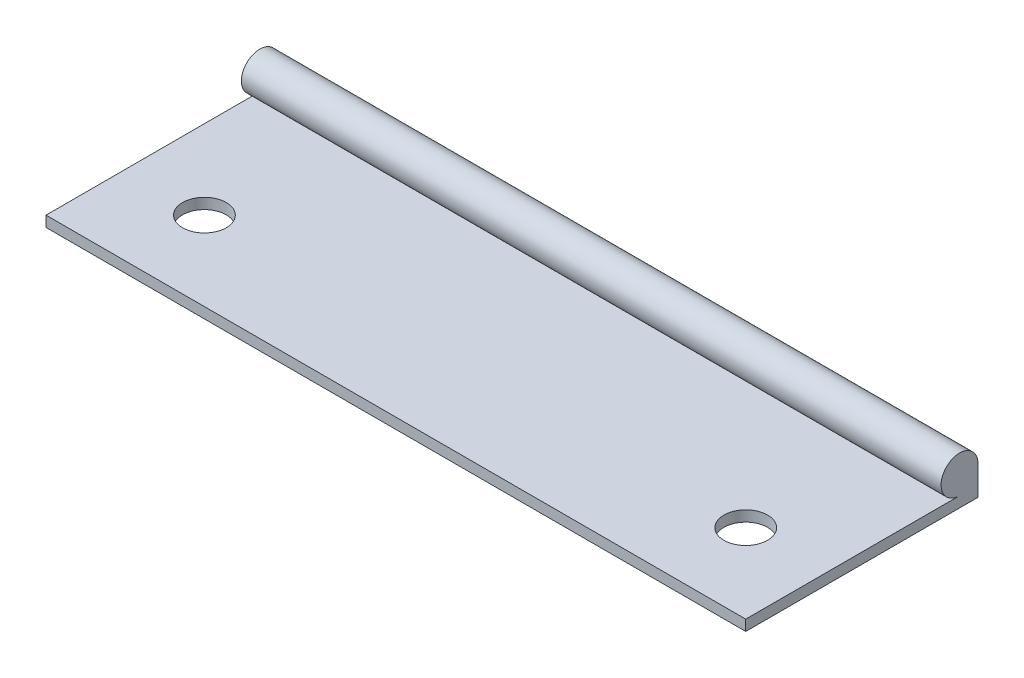
ISO-10303-21;
HEADER;
FILE_DESCRIPTION(('STEP AP214'),'2;1');
FILE_NAME('part.step','',(''),(''),'','','');
FILE_SCHEMA(('AUTOMOTIVE_DESIGN { 1 0 10303 214 1 1 1 1 }'));
ENDSEC;
DATA;
#1=APPLICATION_CONTEXT('core data for automotive mechanical design processes');
#2=APPLICATION_PROTOCOL_DEFINITION('international standard','automotive_design',2000,#1);
#3=PRODUCT_CONTEXT('',#1,'mechanical');
#4=PRODUCT('Part','Part','',(#3));
#5=PRODUCT_RELATED_PRODUCT_CATEGORY('part','',(#4));
#6=PRODUCT_DEFINITION_FORMATION('','',#4);
#7=PRODUCT_DEFINITION_CONTEXT('part definition',#1,'design');
#8=PRODUCT_DEFINITION('design','',#6,#7);
#9=PRODUCT_DEFINITION_SHAPE('','',#8);
#10=(LENGTH_UNIT() NAMED_UNIT(*) SI_UNIT(.MILLI.,.METRE.));
#11=(NAMED_UNIT(*) PLANE_ANGLE_UNIT() SI_UNIT($,.RADIAN.));
#12=(NAMED_UNIT(*) SI_UNIT($,.STERADIAN.) SOLID_ANGLE_UNIT());
#13=UNCERTAINTY_MEASURE_WITH_UNIT(LENGTH_MEASURE(1.E-05),#10,'distance_accuracy_value','');
#14=(GEOMETRIC_REPRESENTATION_CONTEXT(3) GLOBAL_UNCERTAINTY_ASSIGNED_CONTEXT((#13)) GLOBAL_UNIT_ASSIGNED_CONTEXT((#10,
#11,#12)) REPRESENTATION_CONTEXT('',''));
#15=CARTESIAN_POINT('',(0.,0.,0.));
#16=DIRECTION('',(0.,0.,1.));
#17=DIRECTION('',(1.,0.,0.));
#18=AXIS2_PLACEMENT_3D('',#15,#16,#17);
#19=CARTESIAN_POINT('',(72.,3.,-22.));
#20=DIRECTION('',(-1.,0.,0.));
#21=DIRECTION('',(0.,0.,1.));
#22=AXIS2_PLACEMENT_3D('',#19,#20,#21);
#23=CYLINDRICAL_SURFACE('',#22,1.9);
#24=CARTESIAN_POINT('',(0.,3.,-22.));
#25=DIRECTION('',(1.,0.,0.));
#26=DIRECTION('',(0.,0.,-1.));
#27=AXIS2_PLACEMENT_3D('',#24,#25,#26);
#28=CIRCLE('',#27,1.9);
#29=CARTESIAN_POINT('',(0.,3.,-23.9));
#30=VERTEX_POINT('',#29);
#31=CARTESIAN_POINT('',(0.,1.1,-22.));
#32=VERTEX_POINT('',#31);
#33=EDGE_CURVE('E109',#30,#32,#28,.T.);
#34=ORIENTED_EDGE('',*,*,#33,.T.);
#35=DIRECTION('',(-1.,0.,0.));
#36=VECTOR('',#35,1.);
#37=CARTESIAN_POINT('',(72.,1.1,-22.));
#38=LINE('',#37,#36);
#39=CARTESIAN_POINT('',(72.,1.1,-22.));
#40=VERTEX_POINT('',#39);
#41=EDGE_CURVE('E11',#40,#32,#38,.T.);
#42=ORIENTED_EDGE('',*,*,#41,.F.);
#43=CARTESIAN_POINT('',(72.,3.,-22.));
#44=DIRECTION('',(1.,0.,0.));
#45=DIRECTION('',(0.,0.,-1.));
#46=AXIS2_PLACEMENT_3D('',#43,#44,#45);
#47=CIRCLE('',#46,1.9);
#48=CARTESIAN_POINT('',(72.,3.,-23.9));
#49=VERTEX_POINT('',#48);
#50=EDGE_CURVE('E80',#49,#40,#47,.T.);
#51=ORIENTED_EDGE('',*,*,#50,.F.);
#52=DIRECTION('',(-1.,0.,0.));
#53=VECTOR('',#52,1.);
#54=CARTESIAN_POINT('',(72.,3.,-23.9));
#55=LINE('',#54,#53);
#56=EDGE_CURVE('E108',#49,#30,#55,.T.);
#57=ORIENTED_EDGE('',*,*,#56,.T.);
#58=EDGE_LOOP('',(#34,#42,#51,#57));
#59=FACE_BOUND('',#58,.T.);
#60=ADVANCED_FACE('F34',(#59),#23,.T.);
#61=CARTESIAN_POINT('',(72.,1.09999999999999,0.));
#62=DIRECTION('',(0.,1.,0.));
#63=DIRECTION('',(0.,0.,1.));
#64=AXIS2_PLACEMENT_3D('',#61,#62,#63);
#65=PLANE('',#64);
#66=CARTESIAN_POINT('',(63.85,1.09999999999999,-8.15));
#67=DIRECTION('',(0.,1.,0.));
#68=DIRECTION('',(0.,0.,1.));
#69=AXIS2_PLACEMENT_3D('',#66,#67,#68);
#70=CIRCLE('',#69,2.25);
#71=CARTESIAN_POINT('',(63.85,1.09999999999999,-5.9));
#72=VERTEX_POINT('',#71);
#73=EDGE_CURVE('E150',#72,#72,#70,.T.);
#74=ORIENTED_EDGE('',*,*,#73,.F.);
#75=EDGE_LOOP('',(#74));
#76=FACE_BOUND('',#75,.T.);
#77=CARTESIAN_POINT('',(8.15,1.09999999999999,-8.15));
#78=DIRECTION('',(0.,1.,0.));
#79=DIRECTION('',(0.,0.,1.));
#80=AXIS2_PLACEMENT_3D('',#77,#78,#79);
#81=CIRCLE('',#80,2.25);
#82=CARTESIAN_POINT('',(8.15,1.09999999999999,-5.9));
#83=VERTEX_POINT('',#82);
#84=EDGE_CURVE('E153',#83,#83,#81,.T.);
#85=ORIENTED_EDGE('',*,*,#84,.F.);
#86=EDGE_LOOP('',(#85));
#87=FACE_BOUND('',#86,.T.);
#88=DIRECTION('',(0.,0.,-1.));
#89=VECTOR('',#88,1.);
#90=CARTESIAN_POINT('',(0.,1.09999999999999,0.));
#91=LINE('',#90,#89);
#92=CARTESIAN_POINT('',(0.,1.1,0.));
#93=VERTEX_POINT('',#92);
#94=EDGE_CURVE('E112',#93,#32,#91,.T.);
#95=ORIENTED_EDGE('',*,*,#94,.F.);
#96=DIRECTION('',(-1.,0.,0.));
#97=VECTOR('',#96,1.);
#98=CARTESIAN_POINT('',(72.,1.1,0.));
#99=LINE('',#98,#97);
#100=CARTESIAN_POINT('',(72.,1.1,0.));
#101=VERTEX_POINT('',#100);
#102=EDGE_CURVE('E42',#101,#93,#99,.T.);
#103=ORIENTED_EDGE('',*,*,#102,.F.);
#104=DIRECTION('',(0.,0.,-1.));
#105=VECTOR('',#104,1.);
#106=CARTESIAN_POINT('',(72.,1.09999999999999,0.));
#107=LINE('',#106,#105);
#108=EDGE_CURVE('E102',#101,#40,#107,.T.);
#109=ORIENTED_EDGE('',*,*,#108,.T.);
#110=ORIENTED_EDGE('',*,*,#41,.T.);
#111=EDGE_LOOP('',(#95,#103,#109,#110));
#112=FACE_BOUND('',#111,.T.);
#113=ADVANCED_FACE('F122',(#76,#87,#112),#65,.T.);
#114=CARTESIAN_POINT('',(72.,0.,0.));
#115=DIRECTION('',(0.,0.,1.));
#116=DIRECTION('',(1.,0.,0.));
#117=AXIS2_PLACEMENT_3D('',#114,#115,#116);
#118=PLANE('',#117);
#119=DIRECTION('',(0.,1.,0.));
#120=VECTOR('',#119,1.);
#121=CARTESIAN_POINT('',(0.,0.,0.));
#122=LINE('',#121,#120);
#123=CARTESIAN_POINT('',(0.,0.,0.));
#124=VERTEX_POINT('',#123);
#125=EDGE_CURVE('E94',#124,#93,#122,.T.);
#126=ORIENTED_EDGE('',*,*,#125,.F.);
#127=DIRECTION('',(-1.,0.,0.));
#128=VECTOR('',#127,1.);
#129=CARTESIAN_POINT('',(72.,0.,0.));
#130=LINE('',#129,#128);
#131=CARTESIAN_POINT('',(72.,0.,0.));
#132=VERTEX_POINT('',#131);
#133=EDGE_CURVE('E88',#132,#124,#130,.T.);
#134=ORIENTED_EDGE('',*,*,#133,.F.);
#135=DIRECTION('',(0.,1.,0.));
#136=VECTOR('',#135,1.);
#137=CARTESIAN_POINT('',(72.,0.,0.));
#138=LINE('',#137,#136);
#139=EDGE_CURVE('E92',#132,#101,#138,.T.);
#140=ORIENTED_EDGE('',*,*,#139,.T.);
#141=ORIENTED_EDGE('',*,*,#102,.T.);
#142=EDGE_LOOP('',(#126,#134,#140,#141));
#143=FACE_BOUND('',#142,.T.);
#144=ADVANCED_FACE('F90',(#143),#118,.T.);
#145=CARTESIAN_POINT('',(72.,0.,0.));
#146=DIRECTION('',(0.,1.,0.));
#147=DIRECTION('',(0.,0.,1.));
#148=AXIS2_PLACEMENT_3D('',#145,#146,#147);
#149=PLANE('',#148);
#150=CARTESIAN_POINT('',(63.85,0.,-8.15));
#151=DIRECTION('',(0.,1.,0.));
#152=DIRECTION('',(0.,0.,1.));
#153=AXIS2_PLACEMENT_3D('',#150,#151,#152);
#154=CIRCLE('',#153,2.25);
#155=CARTESIAN_POINT('',(63.85,0.,-5.9));
#156=VERTEX_POINT('',#155);
#157=EDGE_CURVE('E155',#156,#156,#154,.T.);
#158=ORIENTED_EDGE('',*,*,#157,.T.);
#159=EDGE_LOOP('',(#158));
#160=FACE_BOUND('',#159,.T.);
#161=CARTESIAN_POINT('',(8.15,0.,-8.15));
#162=DIRECTION('',(0.,1.,0.));
#163=DIRECTION('',(0.,0.,1.));
#164=AXIS2_PLACEMENT_3D('',#161,#162,#163);
#165=CIRCLE('',#164,2.25);
#166=CARTESIAN_POINT('',(8.15,0.,-5.9));
#167=VERTEX_POINT('',#166);
#168=EDGE_CURVE('E113',#167,#167,#165,.T.);
#169=ORIENTED_EDGE('',*,*,#168,.T.);
#170=EDGE_LOOP('',(#169));
#171=FACE_BOUND('',#170,.T.);
#172=DIRECTION('',(0.,0.,-1.));
#173=VECTOR('',#172,1.);
#174=CARTESIAN_POINT('',(0.,0.,0.));
#175=LINE('',#174,#173);
#176=CARTESIAN_POINT('',(0.,0.,-23.9));
#177=VERTEX_POINT('',#176);
#178=EDGE_CURVE('E68',#124,#177,#175,.T.);
#179=ORIENTED_EDGE('',*,*,#178,.T.);
#180=DIRECTION('',(-1.,0.,0.));
#181=VECTOR('',#180,1.);
#182=CARTESIAN_POINT('',(72.,0.,-23.9));
#183=LINE('',#182,#181);
#184=CARTESIAN_POINT('',(72.,0.,-23.9));
#185=VERTEX_POINT('',#184);
#186=EDGE_CURVE('E95',#185,#177,#183,.T.);
#187=ORIENTED_EDGE('',*,*,#186,.F.);
#188=DIRECTION('',(0.,0.,-1.));
#189=VECTOR('',#188,1.);
#190=CARTESIAN_POINT('',(72.,0.,0.));
#191=LINE('',#190,#189);
#192=EDGE_CURVE('E97',#132,#185,#191,.T.);
#193=ORIENTED_EDGE('',*,*,#192,.F.);
#194=ORIENTED_EDGE('',*,*,#133,.T.);
#195=EDGE_LOOP('',(#179,#187,#193,#194));
#196=FACE_BOUND('',#195,.T.);
#197=ADVANCED_FACE('F98',(#160,#171,#196),#149,.F.);
#198=CARTESIAN_POINT('',(72.,0.,-23.9));
#199=DIRECTION('',(0.,0.,1.));
#200=DIRECTION('',(1.,0.,0.));
#201=AXIS2_PLACEMENT_3D('',#198,#199,#200);
#202=PLANE('',#201);
#203=DIRECTION('',(0.,1.,0.));
#204=VECTOR('',#203,1.);
#205=CARTESIAN_POINT('',(0.,0.,-23.9));
#206=LINE('',#205,#204);
#207=EDGE_CURVE('E74',#177,#30,#206,.T.);
#208=ORIENTED_EDGE('',*,*,#207,.T.);
#209=ORIENTED_EDGE('',*,*,#56,.F.);
#210=DIRECTION('',(0.,1.,0.));
#211=VECTOR('',#210,1.);
#212=CARTESIAN_POINT('',(72.,0.,-23.9));
#213=LINE('',#212,#211);
#214=EDGE_CURVE('E50',#185,#49,#213,.T.);
#215=ORIENTED_EDGE('',*,*,#214,.F.);
#216=ORIENTED_EDGE('',*,*,#186,.T.);
#217=EDGE_LOOP('',(#208,#209,#215,#216));
#218=FACE_BOUND('',#217,.T.);
#219=ADVANCED_FACE('F127',(#218),#202,.F.);
#220=CARTESIAN_POINT('',(72.,0.,0.));
#221=DIRECTION('',(1.,0.,0.));
#222=DIRECTION('',(0.,0.,-1.));
#223=AXIS2_PLACEMENT_3D('',#220,#221,#222);
#224=PLANE('',#223);
#225=ORIENTED_EDGE('',*,*,#50,.T.);
#226=ORIENTED_EDGE('',*,*,#108,.F.);
#227=ORIENTED_EDGE('',*,*,#139,.F.);
#228=ORIENTED_EDGE('',*,*,#192,.T.);
#229=ORIENTED_EDGE('',*,*,#214,.T.);
#230=EDGE_LOOP('',(#225,#226,#227,#228,#229));
#231=FACE_BOUND('',#230,.T.);
#232=ADVANCED_FACE('F100',(#231),#224,.T.);
#233=CARTESIAN_POINT('',(0.,0.,0.));
#234=DIRECTION('',(1.,0.,0.));
#235=DIRECTION('',(0.,0.,-1.));
#236=AXIS2_PLACEMENT_3D('',#233,#234,#235);
#237=PLANE('',#236);
#238=ORIENTED_EDGE('',*,*,#33,.F.);
#239=ORIENTED_EDGE('',*,*,#207,.F.);
#240=ORIENTED_EDGE('',*,*,#178,.F.);
#241=ORIENTED_EDGE('',*,*,#125,.T.);
#242=ORIENTED_EDGE('',*,*,#94,.T.);
#243=EDGE_LOOP('',(#238,#239,#240,#241,#242));
#244=FACE_BOUND('',#243,.T.);
#245=ADVANCED_FACE('F125',(#244),#237,.F.);
#246=CARTESIAN_POINT('',(8.15,0.,-8.15));
#247=DIRECTION('',(0.,1.,0.));
#248=DIRECTION('',(0.,0.,1.));
#249=AXIS2_PLACEMENT_3D('',#246,#247,#248);
#250=CYLINDRICAL_SURFACE('',#249,2.25);
#251=ORIENTED_EDGE('',*,*,#168,.F.);
#252=EDGE_LOOP('',(#251));
#253=FACE_BOUND('',#252,.T.);
#254=ORIENTED_EDGE('',*,*,#84,.T.);
#255=EDGE_LOOP('',(#254));
#256=FACE_BOUND('',#255,.T.);
#257=ADVANCED_FACE('F165',(#253,#256),#250,.F.);
#258=CARTESIAN_POINT('',(63.85,0.,-8.15));
#259=DIRECTION('',(0.,1.,0.));
#260=DIRECTION('',(0.,0.,1.));
#261=AXIS2_PLACEMENT_3D('',#258,#259,#260);
#262=CYLINDRICAL_SURFACE('',#261,2.25);
#263=ORIENTED_EDGE('',*,*,#157,.F.);
#264=EDGE_LOOP('',(#263));
#265=FACE_BOUND('',#264,.T.);
#266=ORIENTED_EDGE('',*,*,#73,.T.);
#267=EDGE_LOOP('',(#266));
#268=FACE_BOUND('',#267,.T.);
#269=ADVANCED_FACE('F163',(#265,#268),#262,.F.);
#270=CLOSED_SHELL('',(#60,#113,#144,#197,#219,#232,#245,#257,#269));
#271=MANIFOLD_SOLID_BREP('B2',#270);
#272=ADVANCED_BREP_SHAPE_REPRESENTATION('',(#18,#271),#14);
#273=SHAPE_DEFINITION_REPRESENTATION(#9,#272);
ENDSEC;
END-ISO-10303-21;
